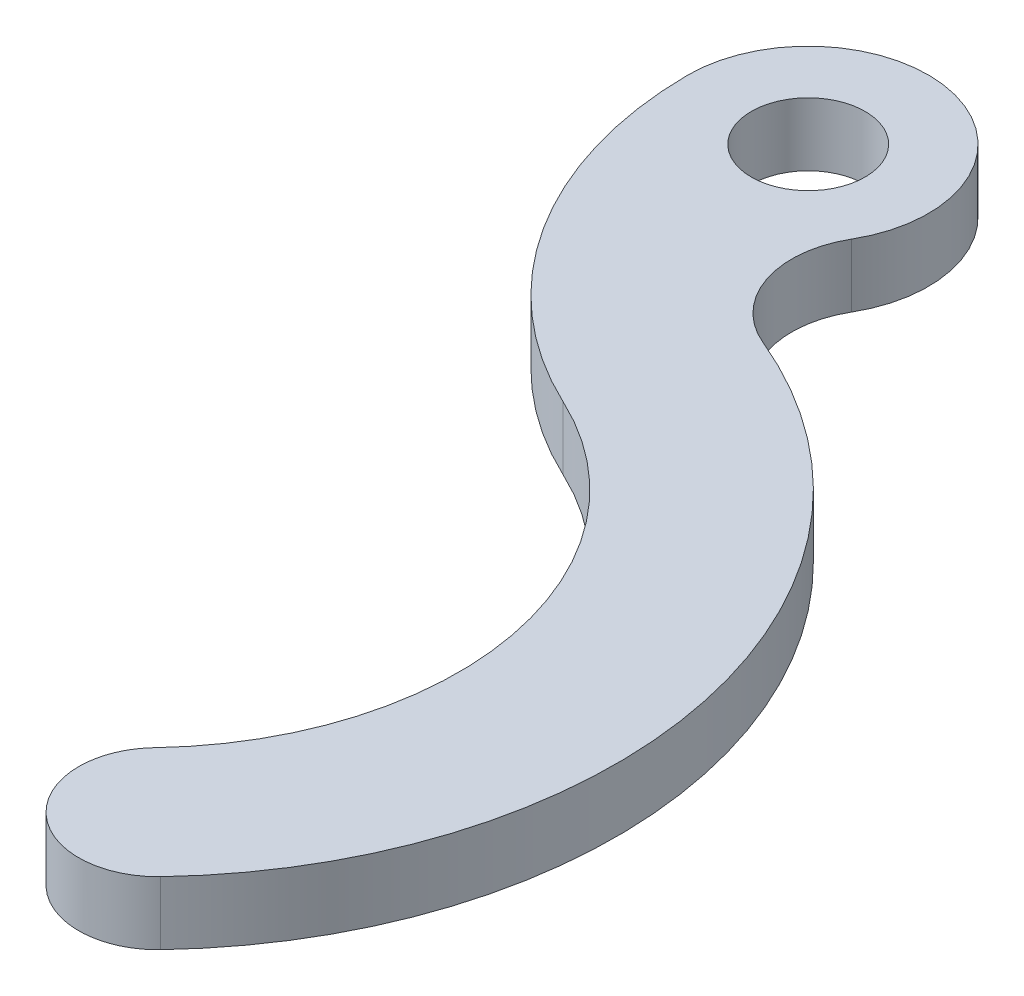
ISO-10303-21;
HEADER;
FILE_DESCRIPTION(('STEP AP214'),'2;1');
FILE_NAME('part.step','',(''),(''),'','','');
FILE_SCHEMA(('AUTOMOTIVE_DESIGN { 1 0 10303 214 1 1 1 1 }'));
ENDSEC;
DATA;
#1=APPLICATION_CONTEXT('core data for automotive mechanical design processes');
#2=APPLICATION_PROTOCOL_DEFINITION('international standard','automotive_design',2000,#1);
#3=PRODUCT_CONTEXT('',#1,'mechanical');
#4=PRODUCT('Part','Part','',(#3));
#5=PRODUCT_RELATED_PRODUCT_CATEGORY('part','',(#4));
#6=PRODUCT_DEFINITION_FORMATION('','',#4);
#7=PRODUCT_DEFINITION_CONTEXT('part definition',#1,'design');
#8=PRODUCT_DEFINITION('design','',#6,#7);
#9=PRODUCT_DEFINITION_SHAPE('','',#8);
#10=(LENGTH_UNIT() NAMED_UNIT(*) SI_UNIT(.MILLI.,.METRE.));
#11=(NAMED_UNIT(*) PLANE_ANGLE_UNIT() SI_UNIT($,.RADIAN.));
#12=(NAMED_UNIT(*) SI_UNIT($,.STERADIAN.) SOLID_ANGLE_UNIT());
#13=UNCERTAINTY_MEASURE_WITH_UNIT(LENGTH_MEASURE(1.E-05),#10,'distance_accuracy_value','');
#14=(GEOMETRIC_REPRESENTATION_CONTEXT(3) GLOBAL_UNCERTAINTY_ASSIGNED_CONTEXT((#13)) GLOBAL_UNIT_ASSIGNED_CONTEXT((#10,
#11,#12)) REPRESENTATION_CONTEXT('',''));
#15=CARTESIAN_POINT('',(0.,0.,0.));
#16=DIRECTION('',(0.,0.,1.));
#17=DIRECTION('',(1.,0.,0.));
#18=AXIS2_PLACEMENT_3D('',#15,#16,#17);
#19=CARTESIAN_POINT('',(19.6491056916114,4.4,60.6101278397606));
#20=CARTESIAN_POINT('',(19.6491056916114,4.26666666666665,60.6101278397606));
#21=CARTESIAN_POINT('',(19.6491056931479,4.13333333333335,60.6101278381394));
#22=CARTESIAN_POINT('',(19.6491056931479,2.66666666666649,60.6101278381394));
#23=CARTESIAN_POINT('',(19.6491056931479,1.33333333333336,60.6101278381394));
#24=CARTESIAN_POINT('',(19.6491056931479,-0.133333333333336,60.6101278381394));
#25=CARTESIAN_POINT('',(19.6491056916114,-0.266666666666663,60.6101278397606));
#26=CARTESIAN_POINT('',(19.6491056916114,-0.400000000000001,60.6101278397606));
#27=CARTESIAN_POINT('',(17.3561506079118,4.4,63.0295219988818));
#28=CARTESIAN_POINT('',(17.3561506079118,4.26666666666665,63.0295219988818));
#29=CARTESIAN_POINT('',(17.3561506098612,4.13333333333335,63.0295219984549));
#30=CARTESIAN_POINT('',(17.3561506098612,2.66666666666649,63.0295219984549));
#31=CARTESIAN_POINT('',(17.3561506098612,1.33333333333336,63.0295219984549));
#32=CARTESIAN_POINT('',(17.3561506098612,-0.133333333333336,63.0295219984549));
#33=CARTESIAN_POINT('',(17.3561506079118,-0.266666666666663,63.0295219988818));
#34=CARTESIAN_POINT('',(17.3561506079118,-0.400000000000001,63.0295219988818));
#35=CARTESIAN_POINT('',(12.6754111335422,4.4,64.334048385174));
#36=CARTESIAN_POINT('',(12.6754111335422,4.26666666666665,64.334048385174));
#37=CARTESIAN_POINT('',(12.6754111343038,4.13333333333335,64.3340483868807));
#38=CARTESIAN_POINT('',(12.6754111343038,2.66666666666649,64.3340483868807));
#39=CARTESIAN_POINT('',(12.6754111343038,1.33333333333336,64.3340483868807));
#40=CARTESIAN_POINT('',(12.6754111343038,-0.133333333333336,64.3340483868807));
#41=CARTESIAN_POINT('',(12.6754111335422,-0.266666666666663,64.334048385174));
#42=CARTESIAN_POINT('',(12.6754111335422,-0.400000000000001,64.334048385174));
#43=CARTESIAN_POINT('',(9.0463198949649,4.4,60.8946157589924));
#44=CARTESIAN_POINT('',(9.0463198949649,4.26666666666665,60.8946157589924));
#45=CARTESIAN_POINT('',(9.04631989414404,4.13333333333335,60.8946157600541));
#46=CARTESIAN_POINT('',(9.04631989414404,2.66666666666649,60.8946157600541));
#47=CARTESIAN_POINT('',(9.04631989414404,1.33333333333336,60.8946157600541));
#48=CARTESIAN_POINT('',(9.04631989414404,-0.133333333333336,60.8946157600541));
#49=CARTESIAN_POINT('',(9.0463198949649,-0.266666666666663,60.8946157589924));
#50=CARTESIAN_POINT('',(9.0463198949649,-0.400000000000001,60.8946157589924));
#51=CARTESIAN_POINT('',(10.0979681313992,4.4,56.150656747127));
#52=CARTESIAN_POINT('',(10.0979681313992,4.26666666666665,56.150656747127));
#53=CARTESIAN_POINT('',(10.0979681314678,4.13333333333335,56.1506567466272));
#54=CARTESIAN_POINT('',(10.0979681314678,2.66666666666649,56.1506567466272));
#55=CARTESIAN_POINT('',(10.0979681314678,1.33333333333336,56.1506567466272));
#56=CARTESIAN_POINT('',(10.0979681314678,-0.133333333333336,56.1506567466272));
#57=CARTESIAN_POINT('',(10.0979681313992,-0.266666666666663,56.150656747127));
#58=CARTESIAN_POINT('',(10.0979681313992,-0.400000000000001,56.150656747127));
#59=CARTESIAN_POINT('',(12.3909232156125,4.4,53.7312625884926));
#60=CARTESIAN_POINT('',(12.3909232156125,4.26666666666665,53.7312625884926));
#61=CARTESIAN_POINT('',(12.3909232162954,4.13333333333335,53.731262587772));
#62=CARTESIAN_POINT('',(12.3909232162954,2.66666666666649,53.731262587772));
#63=CARTESIAN_POINT('',(12.3909232162954,1.33333333333336,53.731262587772));
#64=CARTESIAN_POINT('',(12.3909232162954,-0.133333333333336,53.731262587772));
#65=CARTESIAN_POINT('',(12.3909232156125,-0.266666666666663,53.7312625884926));
#66=CARTESIAN_POINT('',(12.3909232156125,-0.400000000000001,53.7312625884926));
#67=(BOUNDED_SURFACE() B_SPLINE_SURFACE(5,3,((#19,#20,#21,#22,#23,#24,#25,#26),(#27,#28,#29,#30,
#31,#32,#33,#34),(#35,#36,#37,#38,#39,#40,#41,#42),(#43,#44,#45,#46,#47,#48,#49,#50),(#51,#52,
#53,#54,#55,#56,#57,#58),(#59,#60,#61,#62,#63,#64,#65,#66)),.UNSPECIFIED.,.F.,.F.,
.F.) B_SPLINE_SURFACE_WITH_KNOTS((6,6),(4,2,2,4),(0.,1.),(-0.1,0.,1.,1.1),
.UNSPECIFIED.) GEOMETRIC_REPRESENTATION_ITEM() RATIONAL_B_SPLINE_SURFACE(((1.,1.,1.,1.,1.,1.,1.,
1.),(0.599999999957539,0.599999999957539,0.59999999987262,0.59999999987262,0.59999999987262,
0.59999999987262,0.599999999957539,0.599999999957539),(0.399999999936309,0.399999999936309,
0.39999999980893,0.39999999980893,0.39999999980893,0.39999999980893,0.399999999936309,
0.399999999936309),(0.399999999936309,0.399999999936309,0.39999999980893,0.39999999980893,
0.39999999980893,0.39999999980893,0.399999999936309,0.399999999936309),(0.599999999957539,
0.599999999957539,0.59999999987262,0.59999999987262,0.59999999987262,0.59999999987262,
0.599999999957539,0.599999999957539),(1.,1.,1.,1.,1.,1.,1.,1.))) REPRESENTATION_ITEM('') SURFACE());
#68=CARTESIAN_POINT('',(12.3909232156125,4.4,53.7312625884926));
#69=CARTESIAN_POINT('',(12.3909232156125,4.26666666666665,53.7312625884926));
#70=CARTESIAN_POINT('',(12.3909232162954,4.13333333333335,53.731262587772));
#71=CARTESIAN_POINT('',(12.3909232162954,2.66666666666649,53.731262587772));
#72=CARTESIAN_POINT('',(12.3909232162954,1.33333333333336,53.731262587772));
#73=CARTESIAN_POINT('',(12.3909232162954,-0.133333333333336,53.731262587772));
#74=CARTESIAN_POINT('',(12.3909232156125,-0.266666666666663,53.7312625884926));
#75=CARTESIAN_POINT('',(12.3909232156125,-0.400000000000001,53.7312625884926));
#76=(BOUNDED_CURVE() B_SPLINE_CURVE(3,(#68,#69,#70,#71,#72,#73,#74,#75),.UNSPECIFIED.,.F.,
.F.) B_SPLINE_CURVE_WITH_KNOTS((4,2,2,4),(-0.1,0.,1.,1.1),
.UNSPECIFIED.) CURVE() GEOMETRIC_REPRESENTATION_ITEM() RATIONAL_B_SPLINE_CURVE((1.,1.,1.,1.,1.,
1.,1.,1.)) REPRESENTATION_ITEM(''));
#77=CARTESIAN_POINT('',(12.3909232162954,0.,53.731262587772));
#78=VERTEX_POINT('',#77);
#79=CARTESIAN_POINT('',(12.3909232162954,4.,53.731262587772));
#80=VERTEX_POINT('',#79);
#81=EDGE_CURVE('E121',#78,#80,#76,.F.);
#82=CARTESIAN_POINT('',(12.3909232162954,0.,53.731262587772));
#83=CARTESIAN_POINT('',(10.0979681314678,0.,56.1506567466272));
#84=CARTESIAN_POINT('',(9.04631989414404,0.,60.8946157600541));
#85=CARTESIAN_POINT('',(12.6754111343038,0.,64.3340483868807));
#86=CARTESIAN_POINT('',(17.3561506098612,0.,63.0295219984549));
#87=CARTESIAN_POINT('',(19.6491056931479,0.,60.6101278381394));
#88=(BOUNDED_CURVE() B_SPLINE_CURVE(5,(#82,#83,#84,#85,#86,#87),.UNSPECIFIED.,.F.,
.F.) B_SPLINE_CURVE_WITH_KNOTS((6,6),(0.,1.),
.UNSPECIFIED.) CURVE() GEOMETRIC_REPRESENTATION_ITEM() RATIONAL_B_SPLINE_CURVE((1.,
0.59999999987262,0.39999999980893,0.39999999980893,0.59999999987262,1.)) REPRESENTATION_ITEM(''));
#89=CARTESIAN_POINT('',(19.6491056931479,0.,60.6101278381394));
#90=VERTEX_POINT('',#89);
#91=EDGE_CURVE('E52',#90,#78,#88,.F.);
#92=CARTESIAN_POINT('',(19.6491056916114,-0.400000000000001,60.6101278397606));
#93=CARTESIAN_POINT('',(19.6491056916114,-0.266666666666663,60.6101278397606));
#94=CARTESIAN_POINT('',(19.6491056931479,-0.133333333333336,60.6101278381394));
#95=CARTESIAN_POINT('',(19.6491056931479,1.33333333333336,60.6101278381394));
#96=CARTESIAN_POINT('',(19.6491056931479,2.66666666666649,60.6101278381394));
#97=CARTESIAN_POINT('',(19.6491056931479,4.13333333333335,60.6101278381394));
#98=CARTESIAN_POINT('',(19.6491056916114,4.26666666666665,60.6101278397606));
#99=CARTESIAN_POINT('',(19.6491056916114,4.4,60.6101278397606));
#100=(BOUNDED_CURVE() B_SPLINE_CURVE(3,(#92,#93,#94,#95,#96,#97,#98,#99),.UNSPECIFIED.,.F.,
.F.) B_SPLINE_CURVE_WITH_KNOTS((4,2,2,4),(-0.1,0.,1.,1.1),
.UNSPECIFIED.) CURVE() GEOMETRIC_REPRESENTATION_ITEM() RATIONAL_B_SPLINE_CURVE((1.,1.,1.,1.,1.,
1.,1.,1.)) REPRESENTATION_ITEM(''));
#101=CARTESIAN_POINT('',(19.6491056931479,4.,60.6101278381394));
#102=VERTEX_POINT('',#101);
#103=EDGE_CURVE('E124',#102,#90,#100,.F.);
#104=CARTESIAN_POINT('',(19.6491056931479,3.99999999999999,60.6101278381394));
#105=CARTESIAN_POINT('',(17.3561506098612,4.,63.0295219984549));
#106=CARTESIAN_POINT('',(12.6754111343038,4.,64.3340483868807));
#107=CARTESIAN_POINT('',(9.04631989414404,4.,60.8946157600541));
#108=CARTESIAN_POINT('',(10.0979681314678,4.,56.1506567466272));
#109=CARTESIAN_POINT('',(12.3909232162954,3.99999999999999,53.731262587772));
#110=(BOUNDED_CURVE() B_SPLINE_CURVE(5,(#104,#105,#106,#107,#108,#109),.UNSPECIFIED.,.F.,
.F.) B_SPLINE_CURVE_WITH_KNOTS((6,6),(0.,1.),
.UNSPECIFIED.) CURVE() GEOMETRIC_REPRESENTATION_ITEM() RATIONAL_B_SPLINE_CURVE((1.,
0.59999999987262,0.39999999980893,0.39999999980893,0.59999999987262,1.)) REPRESENTATION_ITEM(''));
#111=EDGE_CURVE('E11',#80,#102,#110,.F.);
#112=ORIENTED_EDGE('',*,*,#81,.F.);
#113=ORIENTED_EDGE('',*,*,#91,.F.);
#114=ORIENTED_EDGE('',*,*,#103,.F.);
#115=ORIENTED_EDGE('',*,*,#111,.F.);
#116=EDGE_LOOP('',(#112,#113,#114,#115));
#117=FACE_BOUND('',#116,.T.);
#118=ADVANCED_FACE('F39',(#117),#67,.T.);
#119=CARTESIAN_POINT('',(0.,4.,0.));
#120=DIRECTION('',(0.,1.,0.));
#121=DIRECTION('',(0.,0.,1.));
#122=AXIS2_PLACEMENT_3D('',#119,#120,#121);
#123=PLANE('',#122);
#124=CARTESIAN_POINT('',(-2.12544173587311,4.,39.9735320854162));
#125=DIRECTION('',(0.,-1.,0.));
#126=DIRECTION('',(0.,0.,-1.));
#127=AXIS2_PLACEMENT_3D('',#124,#125,#126);
#128=CIRCLE('',#127,20.);
#129=CARTESIAN_POINT('',(6.36368110010865,4.,21.8645621126206));
#130=VERTEX_POINT('',#129);
#131=EDGE_CURVE('E105',#130,#80,#128,.T.);
#132=ORIENTED_EDGE('',*,*,#131,.T.);
#133=ORIENTED_EDGE('',*,*,#111,.T.);
#134=CARTESIAN_POINT('',(-2.12544173587311,4.,39.9735320854162));
#135=DIRECTION('',(0.,1.,0.));
#136=DIRECTION('',(0.,0.,-1.));
#137=AXIS2_PLACEMENT_3D('',#134,#135,#136);
#138=CIRCLE('',#137,30.);
#139=CARTESIAN_POINT('',(9.41545377438262,4.,12.2822386735627));
#140=VERTEX_POINT('',#139);
#141=EDGE_CURVE('E150',#102,#140,#138,.T.);
#142=ORIENTED_EDGE('',*,*,#141,.T.);
#143=CARTESIAN_POINT('',(11.6980721784523,4.,6.8053104821394));
#144=DIRECTION('',(0.,-1.,0.));
#145=DIRECTION('',(0.,0.,-1.));
#146=AXIS2_PLACEMENT_3D('',#143,#144,#145);
#147=CIRCLE('',#146,5.93355620118363);
#148=CARTESIAN_POINT('',(6.56925254786039,4.,3.82163851802204));
#149=VERTEX_POINT('',#148);
#150=EDGE_CURVE('E112',#140,#149,#147,.T.);
#151=ORIENTED_EDGE('',*,*,#150,.T.);
#152=CARTESIAN_POINT('',(0.,4.,0.));
#153=DIRECTION('',(0.,1.,0.));
#154=DIRECTION('',(0.,0.,1.));
#155=AXIS2_PLACEMENT_3D('',#152,#153,#154);
#156=CIRCLE('',#155,7.6);
#157=CARTESIAN_POINT('',(-7.59985287061061,4.,0.0472900102727011));
#158=VERTEX_POINT('',#157);
#159=EDGE_CURVE('E106',#149,#158,#156,.T.);
#160=ORIENTED_EDGE('',*,*,#159,.T.);
#161=CARTESIAN_POINT('',(16.6619529628389,4.,-0.103678839602645));
#162=DIRECTION('',(0.,1.,0.));
#163=DIRECTION('',(0.,0.,-1.));
#164=AXIS2_PLACEMENT_3D('',#161,#162,#163);
#165=CIRCLE('',#164,24.26227553);
#166=EDGE_CURVE('E96',#158,#130,#165,.T.);
#167=ORIENTED_EDGE('',*,*,#166,.T.);
#168=EDGE_LOOP('',(#132,#133,#142,#151,#160,#167));
#169=FACE_BOUND('',#168,.T.);
#170=CARTESIAN_POINT('',(0.,4.,0.));
#171=DIRECTION('',(0.,1.,0.));
#172=DIRECTION('',(0.,0.,1.));
#173=AXIS2_PLACEMENT_3D('',#170,#171,#172);
#174=CIRCLE('',#173,3.6);
#175=CARTESIAN_POINT('',(0.,4.,3.6));
#176=VERTEX_POINT('',#175);
#177=EDGE_CURVE('E158',#176,#176,#174,.T.);
#178=ORIENTED_EDGE('',*,*,#177,.F.);
#179=EDGE_LOOP('',(#178));
#180=FACE_BOUND('',#179,.T.);
#181=ADVANCED_FACE('F109',(#169,#180),#123,.T.);
#182=CARTESIAN_POINT('',(0.,0.,0.));
#183=DIRECTION('',(0.,1.,0.));
#184=DIRECTION('',(0.,0.,1.));
#185=AXIS2_PLACEMENT_3D('',#182,#183,#184);
#186=PLANE('',#185);
#187=CARTESIAN_POINT('',(-2.12544173587311,0.,39.9735320854162));
#188=DIRECTION('',(0.,1.,0.));
#189=DIRECTION('',(0.,0.,-1.));
#190=AXIS2_PLACEMENT_3D('',#187,#188,#189);
#191=CIRCLE('',#190,30.);
#192=CARTESIAN_POINT('',(9.41545377438262,0.,12.2822386735627));
#193=VERTEX_POINT('',#192);
#194=EDGE_CURVE('E133',#90,#193,#191,.T.);
#195=ORIENTED_EDGE('',*,*,#194,.F.);
#196=ORIENTED_EDGE('',*,*,#91,.T.);
#197=CARTESIAN_POINT('',(-2.12544173587311,0.,39.9735320854162));
#198=DIRECTION('',(0.,-1.,0.));
#199=DIRECTION('',(0.,0.,-1.));
#200=AXIS2_PLACEMENT_3D('',#197,#198,#199);
#201=CIRCLE('',#200,20.);
#202=CARTESIAN_POINT('',(6.36368110010865,0.,21.8645621126206));
#203=VERTEX_POINT('',#202);
#204=EDGE_CURVE('E129',#203,#78,#201,.T.);
#205=ORIENTED_EDGE('',*,*,#204,.F.);
#206=CARTESIAN_POINT('',(16.6619529628389,0.,-0.103678839602645));
#207=DIRECTION('',(0.,1.,0.));
#208=DIRECTION('',(0.,0.,-1.));
#209=AXIS2_PLACEMENT_3D('',#206,#207,#208);
#210=CIRCLE('',#209,24.26227553);
#211=CARTESIAN_POINT('',(-7.59985287061061,0.,0.0472900102727011));
#212=VERTEX_POINT('',#211);
#213=EDGE_CURVE('E134',#212,#203,#210,.T.);
#214=ORIENTED_EDGE('',*,*,#213,.F.);
#215=CARTESIAN_POINT('',(0.,0.,0.));
#216=DIRECTION('',(0.,1.,0.));
#217=DIRECTION('',(0.,0.,1.));
#218=AXIS2_PLACEMENT_3D('',#215,#216,#217);
#219=CIRCLE('',#218,7.6);
#220=CARTESIAN_POINT('',(6.56925254786039,0.,3.82163851802204));
#221=VERTEX_POINT('',#220);
#222=EDGE_CURVE('E120',#221,#212,#219,.T.);
#223=ORIENTED_EDGE('',*,*,#222,.F.);
#224=CARTESIAN_POINT('',(11.6980721784523,0.,6.8053104821394));
#225=DIRECTION('',(0.,-1.,0.));
#226=DIRECTION('',(0.,0.,-1.));
#227=AXIS2_PLACEMENT_3D('',#224,#225,#226);
#228=CIRCLE('',#227,5.93355620118363);
#229=EDGE_CURVE('E116',#193,#221,#228,.T.);
#230=ORIENTED_EDGE('',*,*,#229,.F.);
#231=EDGE_LOOP('',(#195,#196,#205,#214,#223,#230));
#232=FACE_BOUND('',#231,.T.);
#233=CARTESIAN_POINT('',(0.,0.,0.));
#234=DIRECTION('',(0.,1.,0.));
#235=DIRECTION('',(0.,0.,1.));
#236=AXIS2_PLACEMENT_3D('',#233,#234,#235);
#237=CIRCLE('',#236,3.6);
#238=CARTESIAN_POINT('',(0.,0.,3.6));
#239=VERTEX_POINT('',#238);
#240=EDGE_CURVE('E160',#239,#239,#237,.T.);
#241=ORIENTED_EDGE('',*,*,#240,.T.);
#242=EDGE_LOOP('',(#241));
#243=FACE_BOUND('',#242,.T.);
#244=ADVANCED_FACE('F168',(#232,#243),#186,.F.);
#245=CARTESIAN_POINT('',(0.,4.,0.));
#246=DIRECTION('',(0.,-1.,0.));
#247=DIRECTION('',(0.,0.,-1.));
#248=AXIS2_PLACEMENT_3D('',#245,#246,#247);
#249=CYLINDRICAL_SURFACE('',#248,7.6);
#250=ORIENTED_EDGE('',*,*,#222,.T.);
#251=DIRECTION('',(0.,-1.,0.));
#252=VECTOR('',#251,1.);
#253=CARTESIAN_POINT('',(-7.59985287061061,4.,0.0472900102727011));
#254=LINE('',#253,#252);
#255=EDGE_CURVE('E100',#158,#212,#254,.T.);
#256=ORIENTED_EDGE('',*,*,#255,.F.);
#257=ORIENTED_EDGE('',*,*,#159,.F.);
#258=DIRECTION('',(0.,-1.,0.));
#259=VECTOR('',#258,1.);
#260=CARTESIAN_POINT('',(6.56925254786039,4.,3.82163851802204));
#261=LINE('',#260,#259);
#262=EDGE_CURVE('E157',#149,#221,#261,.T.);
#263=ORIENTED_EDGE('',*,*,#262,.T.);
#264=EDGE_LOOP('',(#250,#256,#257,#263));
#265=FACE_BOUND('',#264,.T.);
#266=ADVANCED_FACE('F118',(#265),#249,.T.);
#267=CARTESIAN_POINT('',(16.6619529628389,4.,-0.103678839602645));
#268=DIRECTION('',(0.,-1.,0.));
#269=DIRECTION('',(0.,0.,-1.));
#270=AXIS2_PLACEMENT_3D('',#267,#268,#269);
#271=CYLINDRICAL_SURFACE('',#270,24.26227553);
#272=ORIENTED_EDGE('',*,*,#213,.T.);
#273=DIRECTION('',(0.,-1.,0.));
#274=VECTOR('',#273,1.);
#275=CARTESIAN_POINT('',(6.36368110010865,4.,21.8645621126206));
#276=LINE('',#275,#274);
#277=EDGE_CURVE('E103',#130,#203,#276,.T.);
#278=ORIENTED_EDGE('',*,*,#277,.F.);
#279=ORIENTED_EDGE('',*,*,#166,.F.);
#280=ORIENTED_EDGE('',*,*,#255,.T.);
#281=EDGE_LOOP('',(#272,#278,#279,#280));
#282=FACE_BOUND('',#281,.T.);
#283=ADVANCED_FACE('F98',(#282),#271,.T.);
#284=CARTESIAN_POINT('',(-2.12544173587311,4.,39.9735320854162));
#285=DIRECTION('',(0.,-1.,0.));
#286=DIRECTION('',(0.,0.,-1.));
#287=AXIS2_PLACEMENT_3D('',#284,#285,#286);
#288=CYLINDRICAL_SURFACE('',#287,20.);
#289=ORIENTED_EDGE('',*,*,#204,.T.);
#290=ORIENTED_EDGE('',*,*,#81,.T.);
#291=ORIENTED_EDGE('',*,*,#131,.F.);
#292=ORIENTED_EDGE('',*,*,#277,.T.);
#293=EDGE_LOOP('',(#289,#290,#291,#292));
#294=FACE_BOUND('',#293,.T.);
#295=ADVANCED_FACE('F190',(#294),#288,.F.);
#296=CARTESIAN_POINT('',(-2.12544173587311,4.,39.9735320854162));
#297=DIRECTION('',(0.,-1.,0.));
#298=DIRECTION('',(0.,0.,-1.));
#299=AXIS2_PLACEMENT_3D('',#296,#297,#298);
#300=CYLINDRICAL_SURFACE('',#299,30.);
#301=ORIENTED_EDGE('',*,*,#141,.F.);
#302=ORIENTED_EDGE('',*,*,#103,.T.);
#303=ORIENTED_EDGE('',*,*,#194,.T.);
#304=DIRECTION('',(0.,-1.,0.));
#305=VECTOR('',#304,1.);
#306=CARTESIAN_POINT('',(9.41545377438262,4.,12.2822386735627));
#307=LINE('',#306,#305);
#308=EDGE_CURVE('E125',#140,#193,#307,.T.);
#309=ORIENTED_EDGE('',*,*,#308,.F.);
#310=EDGE_LOOP('',(#301,#302,#303,#309));
#311=FACE_BOUND('',#310,.T.);
#312=ADVANCED_FACE('F177',(#311),#300,.T.);
#313=CARTESIAN_POINT('',(11.6980721784523,4.,6.8053104821394));
#314=DIRECTION('',(0.,-1.,0.));
#315=DIRECTION('',(0.,0.,-1.));
#316=AXIS2_PLACEMENT_3D('',#313,#314,#315);
#317=CYLINDRICAL_SURFACE('',#316,5.93355620118363);
#318=ORIENTED_EDGE('',*,*,#229,.T.);
#319=ORIENTED_EDGE('',*,*,#262,.F.);
#320=ORIENTED_EDGE('',*,*,#150,.F.);
#321=ORIENTED_EDGE('',*,*,#308,.T.);
#322=EDGE_LOOP('',(#318,#319,#320,#321));
#323=FACE_BOUND('',#322,.T.);
#324=ADVANCED_FACE('F172',(#323),#317,.F.);
#325=CARTESIAN_POINT('',(0.,4.,0.));
#326=DIRECTION('',(0.,-1.,0.));
#327=DIRECTION('',(0.,0.,-1.));
#328=AXIS2_PLACEMENT_3D('',#325,#326,#327);
#329=CYLINDRICAL_SURFACE('',#328,3.6);
#330=ORIENTED_EDGE('',*,*,#177,.T.);
#331=EDGE_LOOP('',(#330));
#332=FACE_BOUND('',#331,.T.);
#333=ORIENTED_EDGE('',*,*,#240,.F.);
#334=EDGE_LOOP('',(#333));
#335=FACE_BOUND('',#334,.T.);
#336=ADVANCED_FACE('F170',(#332,#335),#329,.F.);
#337=CLOSED_SHELL('',(#118,#181,#244,#266,#283,#295,#312,#324,#336));
#338=MANIFOLD_SOLID_BREP('B2',#337);
#339=ADVANCED_BREP_SHAPE_REPRESENTATION('',(#18,#338),#14);
#340=SHAPE_DEFINITION_REPRESENTATION(#9,#339);
ENDSEC;
END-ISO-10303-21;
